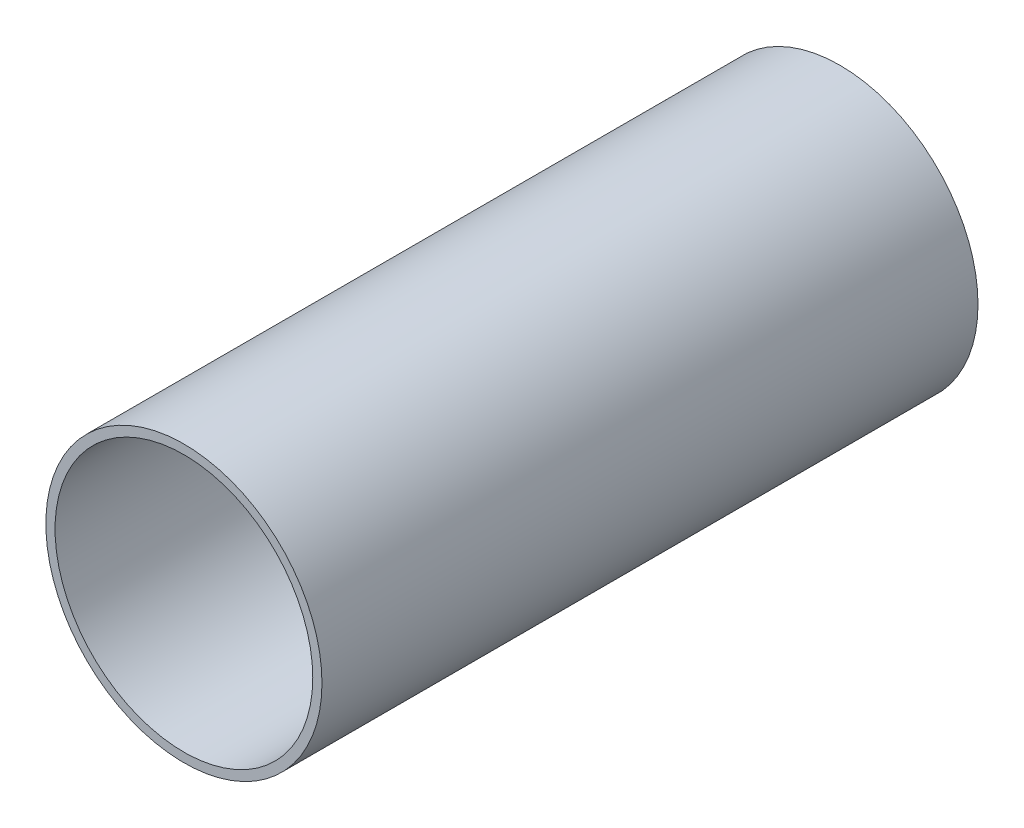
ISO-10303-21;
HEADER;
FILE_DESCRIPTION(('STEP AP214'),'2;1');
FILE_NAME('part.step','',(''),(''),'','','');
FILE_SCHEMA(('AUTOMOTIVE_DESIGN { 1 0 10303 214 1 1 1 1 }'));
ENDSEC;
DATA;
#1=APPLICATION_CONTEXT('core data for automotive mechanical design processes');
#2=APPLICATION_PROTOCOL_DEFINITION('international standard','automotive_design',2000,#1);
#3=PRODUCT_CONTEXT('',#1,'mechanical');
#4=PRODUCT('Part','Part','',(#3));
#5=PRODUCT_RELATED_PRODUCT_CATEGORY('part','',(#4));
#6=PRODUCT_DEFINITION_FORMATION('','',#4);
#7=PRODUCT_DEFINITION_CONTEXT('part definition',#1,'design');
#8=PRODUCT_DEFINITION('design','',#6,#7);
#9=PRODUCT_DEFINITION_SHAPE('','',#8);
#10=(LENGTH_UNIT() NAMED_UNIT(*) SI_UNIT(.MILLI.,.METRE.));
#11=(NAMED_UNIT(*) PLANE_ANGLE_UNIT() SI_UNIT($,.RADIAN.));
#12=(NAMED_UNIT(*) SI_UNIT($,.STERADIAN.) SOLID_ANGLE_UNIT());
#13=UNCERTAINTY_MEASURE_WITH_UNIT(LENGTH_MEASURE(1.E-05),#10,'distance_accuracy_value','');
#14=(GEOMETRIC_REPRESENTATION_CONTEXT(3) GLOBAL_UNCERTAINTY_ASSIGNED_CONTEXT((#13)) GLOBAL_UNIT_ASSIGNED_CONTEXT((#10,
#11,#12)) REPRESENTATION_CONTEXT('',''));
#15=CARTESIAN_POINT('',(0.,0.,0.));
#16=DIRECTION('',(0.,0.,1.));
#17=DIRECTION('',(1.,0.,0.));
#18=AXIS2_PLACEMENT_3D('',#15,#16,#17);
#19=CARTESIAN_POINT('',(0.,0.,-20.));
#20=DIRECTION('',(0.,0.,1.));
#21=DIRECTION('',(1.,0.,0.));
#22=AXIS2_PLACEMENT_3D('',#19,#20,#21);
#23=CYLINDRICAL_SURFACE('',#22,30.);
#24=CARTESIAN_POINT('',(0.,0.,100.));
#25=DIRECTION('',(0.,0.,1.));
#26=DIRECTION('',(1.,0.,0.));
#27=AXIS2_PLACEMENT_3D('',#24,#25,#26);
#28=CIRCLE('',#27,30.);
#29=CARTESIAN_POINT('',(30.,0.,100.));
#30=VERTEX_POINT('',#29);
#31=EDGE_CURVE('E10',#30,#30,#28,.T.);
#32=ORIENTED_EDGE('',*,*,#31,.F.);
#33=EDGE_LOOP('',(#32));
#34=FACE_BOUND('',#33,.T.);
#35=CARTESIAN_POINT('',(0.,0.,-42.5495537373532));
#36=DIRECTION('',(0.,0.,-1.));
#37=DIRECTION('',(-1.,0.,0.));
#38=AXIS2_PLACEMENT_3D('',#35,#36,#37);
#39=CIRCLE('',#38,30.);
#40=CARTESIAN_POINT('',(-30.,0.,-42.5495537373532));
#41=VERTEX_POINT('',#40);
#42=EDGE_CURVE('E40',#41,#41,#39,.T.);
#43=ORIENTED_EDGE('',*,*,#42,.F.);
#44=EDGE_LOOP('',(#43));
#45=FACE_BOUND('',#44,.T.);
#46=ADVANCED_FACE('F30',(#34,#45),#23,.T.);
#47=CARTESIAN_POINT('',(0.,0.,-20.));
#48=DIRECTION('',(0.,0.,1.));
#49=DIRECTION('',(1.,0.,0.));
#50=AXIS2_PLACEMENT_3D('',#47,#48,#49);
#51=CYLINDRICAL_SURFACE('',#50,28.);
#52=CARTESIAN_POINT('',(0.,0.,100.));
#53=DIRECTION('',(0.,0.,1.));
#54=DIRECTION('',(1.,0.,0.));
#55=AXIS2_PLACEMENT_3D('',#52,#53,#54);
#56=CIRCLE('',#55,28.);
#57=CARTESIAN_POINT('',(28.,0.,100.));
#58=VERTEX_POINT('',#57);
#59=EDGE_CURVE('E36',#58,#58,#56,.T.);
#60=ORIENTED_EDGE('',*,*,#59,.T.);
#61=EDGE_LOOP('',(#60));
#62=FACE_BOUND('',#61,.T.);
#63=CARTESIAN_POINT('',(0.,0.,-42.5495537373532));
#64=DIRECTION('',(0.,0.,-1.));
#65=DIRECTION('',(-1.,0.,0.));
#66=AXIS2_PLACEMENT_3D('',#63,#64,#65);
#67=CIRCLE('',#66,28.);
#68=CARTESIAN_POINT('',(-28.,0.,-42.5495537373532));
#69=VERTEX_POINT('',#68);
#70=EDGE_CURVE('E44',#69,#69,#67,.T.);
#71=ORIENTED_EDGE('',*,*,#70,.T.);
#72=EDGE_LOOP('',(#71));
#73=FACE_BOUND('',#72,.T.);
#74=ADVANCED_FACE('F50',(#62,#73),#51,.F.);
#75=CARTESIAN_POINT('',(0.,0.,100.));
#76=DIRECTION('',(0.,0.,1.));
#77=DIRECTION('',(1.,0.,0.));
#78=AXIS2_PLACEMENT_3D('',#75,#76,#77);
#79=PLANE('',#78);
#80=ORIENTED_EDGE('',*,*,#31,.T.);
#81=EDGE_LOOP('',(#80));
#82=FACE_BOUND('',#81,.T.);
#83=ORIENTED_EDGE('',*,*,#59,.F.);
#84=EDGE_LOOP('',(#83));
#85=FACE_BOUND('',#84,.T.);
#86=ADVANCED_FACE('F55',(#82,#85),#79,.T.);
#87=CARTESIAN_POINT('',(0.,0.,-42.5495537373532));
#88=DIRECTION('',(0.,0.,-1.));
#89=DIRECTION('',(-1.,0.,0.));
#90=AXIS2_PLACEMENT_3D('',#87,#88,#89);
#91=PLANE('',#90);
#92=ORIENTED_EDGE('',*,*,#70,.F.);
#93=EDGE_LOOP('',(#92));
#94=FACE_BOUND('',#93,.T.);
#95=ORIENTED_EDGE('',*,*,#42,.T.);
#96=EDGE_LOOP('',(#95));
#97=FACE_BOUND('',#96,.T.);
#98=ADVANCED_FACE('F52',(#94,#97),#91,.T.);
#99=CLOSED_SHELL('',(#46,#74,#86,#98));
#100=MANIFOLD_SOLID_BREP('B2',#99);
#101=ADVANCED_BREP_SHAPE_REPRESENTATION('',(#18,#100),#14);
#102=SHAPE_DEFINITION_REPRESENTATION(#9,#101);
ENDSEC;
END-ISO-10303-21;
